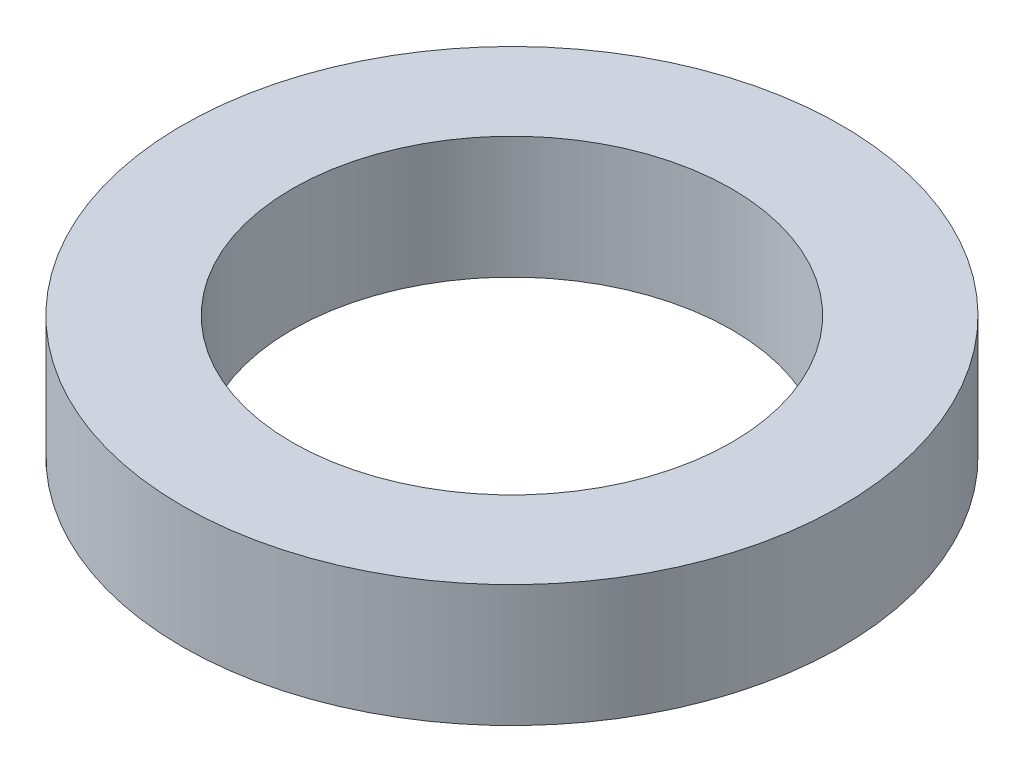
ISO-10303-21;
HEADER;
FILE_DESCRIPTION(('STEP AP214'),'2;1');
FILE_NAME('part.step','',(''),(''),'','','');
FILE_SCHEMA(('AUTOMOTIVE_DESIGN { 1 0 10303 214 1 1 1 1 }'));
ENDSEC;
DATA;
#1=APPLICATION_CONTEXT('core data for automotive mechanical design processes');
#2=APPLICATION_PROTOCOL_DEFINITION('international standard','automotive_design',2000,#1);
#3=PRODUCT_CONTEXT('',#1,'mechanical');
#4=PRODUCT('Part','Part','',(#3));
#5=PRODUCT_RELATED_PRODUCT_CATEGORY('part','',(#4));
#6=PRODUCT_DEFINITION_FORMATION('','',#4);
#7=PRODUCT_DEFINITION_CONTEXT('part definition',#1,'design');
#8=PRODUCT_DEFINITION('design','',#6,#7);
#9=PRODUCT_DEFINITION_SHAPE('','',#8);
#10=(LENGTH_UNIT() NAMED_UNIT(*) SI_UNIT(.MILLI.,.METRE.));
#11=(NAMED_UNIT(*) PLANE_ANGLE_UNIT() SI_UNIT($,.RADIAN.));
#12=(NAMED_UNIT(*) SI_UNIT($,.STERADIAN.) SOLID_ANGLE_UNIT());
#13=UNCERTAINTY_MEASURE_WITH_UNIT(LENGTH_MEASURE(1.E-05),#10,'distance_accuracy_value','');
#14=(GEOMETRIC_REPRESENTATION_CONTEXT(3) GLOBAL_UNCERTAINTY_ASSIGNED_CONTEXT((#13)) GLOBAL_UNIT_ASSIGNED_CONTEXT((#10,
#11,#12)) REPRESENTATION_CONTEXT('',''));
#15=CARTESIAN_POINT('',(0.,0.,0.));
#16=DIRECTION('',(0.,0.,1.));
#17=DIRECTION('',(1.,0.,0.));
#18=AXIS2_PLACEMENT_3D('',#15,#16,#17);
#19=CARTESIAN_POINT('',(0.,25.,0.));
#20=DIRECTION('',(0.,-1.,0.));
#21=DIRECTION('',(0.,0.,-1.));
#22=AXIS2_PLACEMENT_3D('',#19,#20,#21);
#23=CYLINDRICAL_SURFACE('',#22,67.5);
#24=CARTESIAN_POINT('',(0.,25.,0.));
#25=DIRECTION('',(0.,1.,0.));
#26=DIRECTION('',(0.,0.,1.));
#27=AXIS2_PLACEMENT_3D('',#24,#25,#26);
#28=CIRCLE('',#27,67.5);
#29=CARTESIAN_POINT('',(0.,25.,67.5));
#30=VERTEX_POINT('',#29);
#31=EDGE_CURVE('E10',#30,#30,#28,.T.);
#32=ORIENTED_EDGE('',*,*,#31,.F.);
#33=EDGE_LOOP('',(#32));
#34=FACE_BOUND('',#33,.T.);
#35=CARTESIAN_POINT('',(0.,0.,0.));
#36=DIRECTION('',(0.,1.,0.));
#37=DIRECTION('',(0.,0.,1.));
#38=AXIS2_PLACEMENT_3D('',#35,#36,#37);
#39=CIRCLE('',#38,67.5);
#40=CARTESIAN_POINT('',(0.,0.,67.5));
#41=VERTEX_POINT('',#40);
#42=EDGE_CURVE('E37',#41,#41,#39,.T.);
#43=ORIENTED_EDGE('',*,*,#42,.T.);
#44=EDGE_LOOP('',(#43));
#45=FACE_BOUND('',#44,.T.);
#46=ADVANCED_FACE('F40',(#34,#45),#23,.T.);
#47=CARTESIAN_POINT('',(0.,25.,0.));
#48=DIRECTION('',(0.,1.,0.));
#49=DIRECTION('',(0.,0.,1.));
#50=AXIS2_PLACEMENT_3D('',#47,#48,#49);
#51=PLANE('',#50);
#52=CARTESIAN_POINT('',(0.,25.,0.));
#53=DIRECTION('',(0.,1.,0.));
#54=DIRECTION('',(0.,0.,1.));
#55=AXIS2_PLACEMENT_3D('',#52,#53,#54);
#56=CIRCLE('',#55,45.);
#57=CARTESIAN_POINT('',(0.,25.,45.));
#58=VERTEX_POINT('',#57);
#59=EDGE_CURVE('E50',#58,#58,#56,.T.);
#60=ORIENTED_EDGE('',*,*,#59,.F.);
#61=EDGE_LOOP('',(#60));
#62=FACE_BOUND('',#61,.T.);
#63=ORIENTED_EDGE('',*,*,#31,.T.);
#64=EDGE_LOOP('',(#63));
#65=FACE_BOUND('',#64,.T.);
#66=ADVANCED_FACE('F59',(#62,#65),#51,.T.);
#67=CARTESIAN_POINT('',(0.,0.,0.));
#68=DIRECTION('',(0.,1.,0.));
#69=DIRECTION('',(0.,0.,1.));
#70=AXIS2_PLACEMENT_3D('',#67,#68,#69);
#71=PLANE('',#70);
#72=CARTESIAN_POINT('',(0.,0.,0.));
#73=DIRECTION('',(0.,1.,0.));
#74=DIRECTION('',(0.,0.,1.));
#75=AXIS2_PLACEMENT_3D('',#72,#73,#74);
#76=CIRCLE('',#75,45.);
#77=CARTESIAN_POINT('',(0.,0.,45.));
#78=VERTEX_POINT('',#77);
#79=EDGE_CURVE('E47',#78,#78,#76,.T.);
#80=ORIENTED_EDGE('',*,*,#79,.T.);
#81=EDGE_LOOP('',(#80));
#82=FACE_BOUND('',#81,.T.);
#83=ORIENTED_EDGE('',*,*,#42,.F.);
#84=EDGE_LOOP('',(#83));
#85=FACE_BOUND('',#84,.T.);
#86=ADVANCED_FACE('F58',(#82,#85),#71,.F.);
#87=CARTESIAN_POINT('',(0.,25.,0.));
#88=DIRECTION('',(0.,-1.,0.));
#89=DIRECTION('',(0.,0.,-1.));
#90=AXIS2_PLACEMENT_3D('',#87,#88,#89);
#91=CYLINDRICAL_SURFACE('',#90,45.);
#92=ORIENTED_EDGE('',*,*,#59,.T.);
#93=EDGE_LOOP('',(#92));
#94=FACE_BOUND('',#93,.T.);
#95=ORIENTED_EDGE('',*,*,#79,.F.);
#96=EDGE_LOOP('',(#95));
#97=FACE_BOUND('',#96,.T.);
#98=ADVANCED_FACE('F54',(#94,#97),#91,.F.);
#99=CLOSED_SHELL('',(#46,#66,#86,#98));
#100=MANIFOLD_SOLID_BREP('B2',#99);
#101=ADVANCED_BREP_SHAPE_REPRESENTATION('',(#18,#100),#14);
#102=SHAPE_DEFINITION_REPRESENTATION(#9,#101);
ENDSEC;
END-ISO-10303-21;
